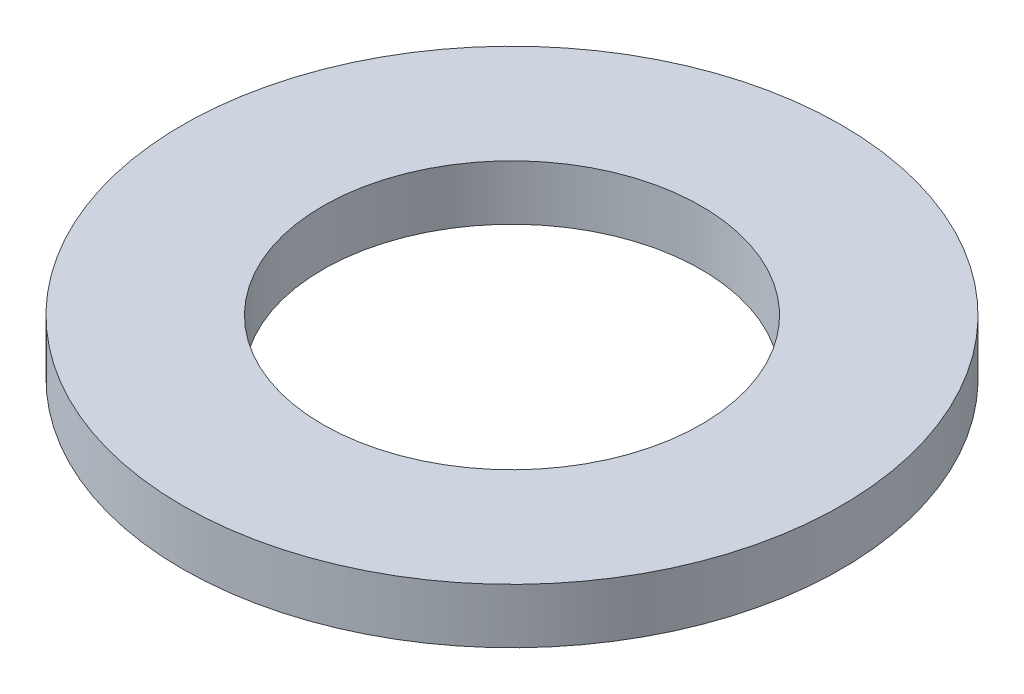
ISO-10303-21;
HEADER;
FILE_DESCRIPTION(('STEP AP214'),'2;1');
FILE_NAME('part.step','',(''),(''),'','','');
FILE_SCHEMA(('AUTOMOTIVE_DESIGN { 1 0 10303 214 1 1 1 1 }'));
ENDSEC;
DATA;
#1=APPLICATION_CONTEXT('core data for automotive mechanical design processes');
#2=APPLICATION_PROTOCOL_DEFINITION('international standard','automotive_design',2000,#1);
#3=PRODUCT_CONTEXT('',#1,'mechanical');
#4=PRODUCT('Part','Part','',(#3));
#5=PRODUCT_RELATED_PRODUCT_CATEGORY('part','',(#4));
#6=PRODUCT_DEFINITION_FORMATION('','',#4);
#7=PRODUCT_DEFINITION_CONTEXT('part definition',#1,'design');
#8=PRODUCT_DEFINITION('design','',#6,#7);
#9=PRODUCT_DEFINITION_SHAPE('','',#8);
#10=(LENGTH_UNIT() NAMED_UNIT(*) SI_UNIT(.MILLI.,.METRE.));
#11=(NAMED_UNIT(*) PLANE_ANGLE_UNIT() SI_UNIT($,.RADIAN.));
#12=(NAMED_UNIT(*) SI_UNIT($,.STERADIAN.) SOLID_ANGLE_UNIT());
#13=UNCERTAINTY_MEASURE_WITH_UNIT(LENGTH_MEASURE(1.E-05),#10,'distance_accuracy_value','');
#14=(GEOMETRIC_REPRESENTATION_CONTEXT(3) GLOBAL_UNCERTAINTY_ASSIGNED_CONTEXT((#13)) GLOBAL_UNIT_ASSIGNED_CONTEXT((#10,
#11,#12)) REPRESENTATION_CONTEXT('',''));
#15=CARTESIAN_POINT('',(0.,0.,0.));
#16=DIRECTION('',(0.,0.,1.));
#17=DIRECTION('',(1.,0.,0.));
#18=AXIS2_PLACEMENT_3D('',#15,#16,#17);
#19=CARTESIAN_POINT('',(0.,0.254,0.));
#20=DIRECTION('',(0.,1.,0.));
#21=DIRECTION('',(0.,0.,1.));
#22=AXIS2_PLACEMENT_3D('',#19,#20,#21);
#23=PLANE('',#22);
#24=CARTESIAN_POINT('',(0.,0.254,0.));
#25=DIRECTION('',(0.,1.,0.));
#26=DIRECTION('',(0.,0.,1.));
#27=AXIS2_PLACEMENT_3D('',#24,#25,#26);
#28=CIRCLE('',#27,1.524);
#29=CARTESIAN_POINT('',(0.,0.254,1.524));
#30=VERTEX_POINT('',#29);
#31=EDGE_CURVE('E10',#30,#30,#28,.T.);
#32=ORIENTED_EDGE('',*,*,#31,.T.);
#33=EDGE_LOOP('',(#32));
#34=FACE_BOUND('',#33,.T.);
#35=CARTESIAN_POINT('',(0.,0.254,0.));
#36=DIRECTION('',(0.,1.,0.));
#37=DIRECTION('',(0.,0.,1.));
#38=AXIS2_PLACEMENT_3D('',#35,#36,#37);
#39=CIRCLE('',#38,0.875);
#40=CARTESIAN_POINT('',(0.,0.254,0.875));
#41=VERTEX_POINT('',#40);
#42=EDGE_CURVE('E46',#41,#41,#39,.T.);
#43=ORIENTED_EDGE('',*,*,#42,.F.);
#44=EDGE_LOOP('',(#43));
#45=FACE_BOUND('',#44,.T.);
#46=ADVANCED_FACE('F35',(#34,#45),#23,.T.);
#47=CARTESIAN_POINT('',(0.,0.,0.));
#48=DIRECTION('',(0.,1.,0.));
#49=DIRECTION('',(0.,0.,1.));
#50=AXIS2_PLACEMENT_3D('',#47,#48,#49);
#51=PLANE('',#50);
#52=CARTESIAN_POINT('',(0.,0.,0.));
#53=DIRECTION('',(0.,1.,0.));
#54=DIRECTION('',(0.,0.,1.));
#55=AXIS2_PLACEMENT_3D('',#52,#53,#54);
#56=CIRCLE('',#55,1.524);
#57=CARTESIAN_POINT('',(0.,0.,1.524));
#58=VERTEX_POINT('',#57);
#59=EDGE_CURVE('E39',#58,#58,#56,.T.);
#60=ORIENTED_EDGE('',*,*,#59,.F.);
#61=EDGE_LOOP('',(#60));
#62=FACE_BOUND('',#61,.T.);
#63=CARTESIAN_POINT('',(0.,0.,0.));
#64=DIRECTION('',(0.,1.,0.));
#65=DIRECTION('',(0.,0.,1.));
#66=AXIS2_PLACEMENT_3D('',#63,#64,#65);
#67=CIRCLE('',#66,0.875);
#68=CARTESIAN_POINT('',(0.,0.,0.875));
#69=VERTEX_POINT('',#68);
#70=EDGE_CURVE('E48',#69,#69,#67,.T.);
#71=ORIENTED_EDGE('',*,*,#70,.T.);
#72=EDGE_LOOP('',(#71));
#73=FACE_BOUND('',#72,.T.);
#74=ADVANCED_FACE('F58',(#62,#73),#51,.F.);
#75=CARTESIAN_POINT('',(0.,0.254,0.));
#76=DIRECTION('',(0.,-1.,0.));
#77=DIRECTION('',(0.,0.,-1.));
#78=AXIS2_PLACEMENT_3D('',#75,#76,#77);
#79=CYLINDRICAL_SURFACE('',#78,1.524);
#80=ORIENTED_EDGE('',*,*,#31,.F.);
#81=EDGE_LOOP('',(#80));
#82=FACE_BOUND('',#81,.T.);
#83=ORIENTED_EDGE('',*,*,#59,.T.);
#84=EDGE_LOOP('',(#83));
#85=FACE_BOUND('',#84,.T.);
#86=ADVANCED_FACE('F37',(#82,#85),#79,.T.);
#87=CARTESIAN_POINT('',(0.,0.254,0.));
#88=DIRECTION('',(0.,-1.,0.));
#89=DIRECTION('',(0.,0.,-1.));
#90=AXIS2_PLACEMENT_3D('',#87,#88,#89);
#91=CYLINDRICAL_SURFACE('',#90,0.875);
#92=ORIENTED_EDGE('',*,*,#42,.T.);
#93=EDGE_LOOP('',(#92));
#94=FACE_BOUND('',#93,.T.);
#95=ORIENTED_EDGE('',*,*,#70,.F.);
#96=EDGE_LOOP('',(#95));
#97=FACE_BOUND('',#96,.T.);
#98=ADVANCED_FACE('F54',(#94,#97),#91,.F.);
#99=CLOSED_SHELL('',(#46,#74,#86,#98));
#100=MANIFOLD_SOLID_BREP('B2',#99);
#101=ADVANCED_BREP_SHAPE_REPRESENTATION('',(#18,#100),#14);
#102=SHAPE_DEFINITION_REPRESENTATION(#9,#101);
ENDSEC;
END-ISO-10303-21;
